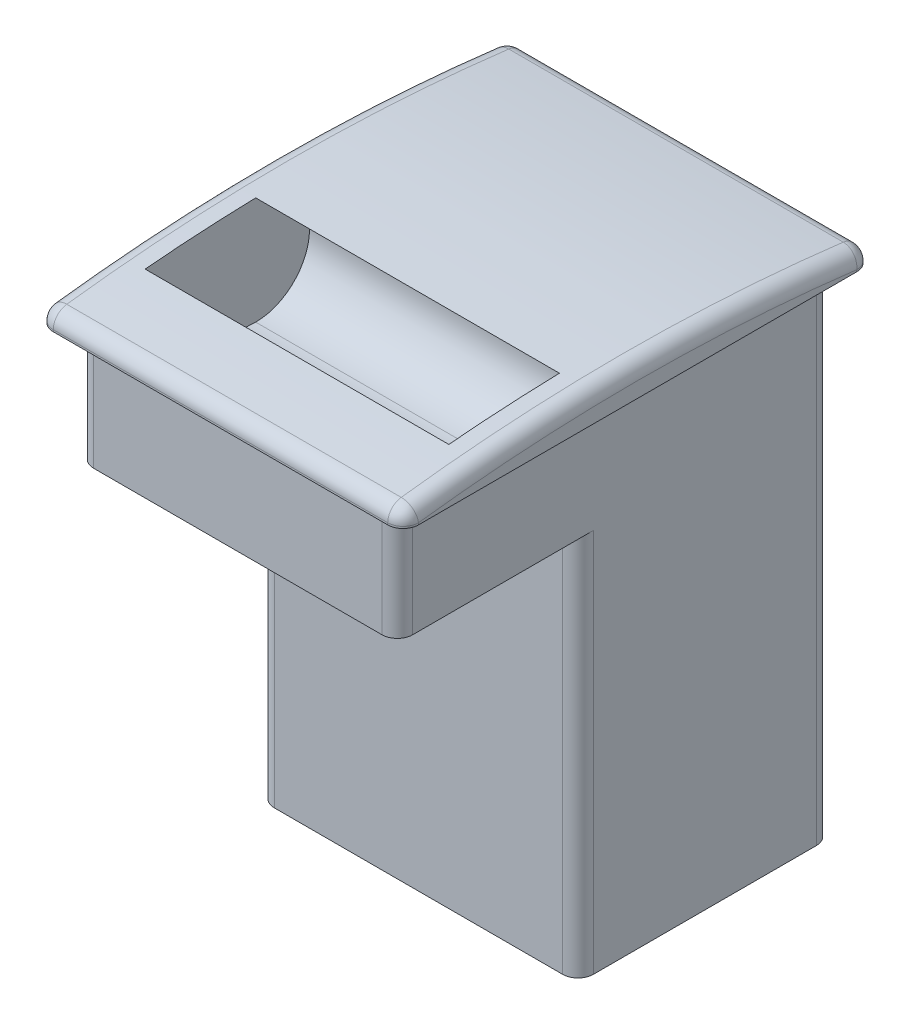
ISO-10303-21;
HEADER;
FILE_DESCRIPTION(('STEP AP214'),'2;1');
FILE_NAME('part.step','',(''),(''),'','','');
FILE_SCHEMA(('AUTOMOTIVE_DESIGN { 1 0 10303 214 1 1 1 1 }'));
ENDSEC;
DATA;
#1=APPLICATION_CONTEXT('core data for automotive mechanical design processes');
#2=APPLICATION_PROTOCOL_DEFINITION('international standard','automotive_design',2000,#1);
#3=PRODUCT_CONTEXT('',#1,'mechanical');
#4=PRODUCT('Part','Part','',(#3));
#5=PRODUCT_RELATED_PRODUCT_CATEGORY('part','',(#4));
#6=PRODUCT_DEFINITION_FORMATION('','',#4);
#7=PRODUCT_DEFINITION_CONTEXT('part definition',#1,'design');
#8=PRODUCT_DEFINITION('design','',#6,#7);
#9=PRODUCT_DEFINITION_SHAPE('','',#8);
#10=(LENGTH_UNIT() NAMED_UNIT(*) SI_UNIT(.MILLI.,.METRE.));
#11=(NAMED_UNIT(*) PLANE_ANGLE_UNIT() SI_UNIT($,.RADIAN.));
#12=(NAMED_UNIT(*) SI_UNIT($,.STERADIAN.) SOLID_ANGLE_UNIT());
#13=UNCERTAINTY_MEASURE_WITH_UNIT(LENGTH_MEASURE(1.E-05),#10,'distance_accuracy_value','');
#14=(GEOMETRIC_REPRESENTATION_CONTEXT(3) GLOBAL_UNCERTAINTY_ASSIGNED_CONTEXT((#13)) GLOBAL_UNIT_ASSIGNED_CONTEXT((#10,
#11,#12)) REPRESENTATION_CONTEXT('',''));
#15=CARTESIAN_POINT('',(0.,0.,0.));
#16=DIRECTION('',(0.,0.,1.));
#17=DIRECTION('',(1.,0.,0.));
#18=AXIS2_PLACEMENT_3D('',#15,#16,#17);
#19=CARTESIAN_POINT('',(0.,-15.,0.));
#20=DIRECTION('',(0.,1.,0.));
#21=DIRECTION('',(0.,0.,1.));
#22=AXIS2_PLACEMENT_3D('',#19,#20,#21);
#23=PLANE('',#22);
#24=DIRECTION('',(0.,0.,-1.));
#25=VECTOR('',#24,1.);
#26=CARTESIAN_POINT('',(20.75,-15.,-28.25));
#27=LINE('',#26,#25);
#28=CARTESIAN_POINT('',(20.75,-15.,26.25));
#29=VERTEX_POINT('',#28);
#30=CARTESIAN_POINT('',(20.75,-15.,2.75));
#31=VERTEX_POINT('',#30);
#32=EDGE_CURVE('E493',#29,#31,#27,.T.);
#33=ORIENTED_EDGE('',*,*,#32,.F.);
#34=CARTESIAN_POINT('',(18.75,-15.,26.25));
#35=DIRECTION('',(0.,1.,0.));
#36=DIRECTION('',(0.,0.,1.));
#37=AXIS2_PLACEMENT_3D('',#34,#35,#36);
#38=CIRCLE('',#37,2.);
#39=CARTESIAN_POINT('',(18.75,-15.,28.25));
#40=VERTEX_POINT('',#39);
#41=EDGE_CURVE('E372',#29,#40,#38,.F.);
#42=ORIENTED_EDGE('',*,*,#41,.T.);
#43=DIRECTION('',(1.,0.,0.));
#44=VECTOR('',#43,1.);
#45=CARTESIAN_POINT('',(-20.75,-15.,28.25));
#46=LINE('',#45,#44);
#47=CARTESIAN_POINT('',(-18.75,-15.,28.25));
#48=VERTEX_POINT('',#47);
#49=EDGE_CURVE('E240',#48,#40,#46,.T.);
#50=ORIENTED_EDGE('',*,*,#49,.F.);
#51=CARTESIAN_POINT('',(-18.75,-15.,26.25));
#52=DIRECTION('',(0.,1.,0.));
#53=DIRECTION('',(0.,0.,1.));
#54=AXIS2_PLACEMENT_3D('',#51,#52,#53);
#55=CIRCLE('',#54,2.);
#56=CARTESIAN_POINT('',(-20.75,-15.,26.25));
#57=VERTEX_POINT('',#56);
#58=EDGE_CURVE('E369',#48,#57,#55,.F.);
#59=ORIENTED_EDGE('',*,*,#58,.T.);
#60=DIRECTION('',(0.,0.,1.));
#61=VECTOR('',#60,1.);
#62=CARTESIAN_POINT('',(-20.75,-15.,-28.25));
#63=LINE('',#62,#61);
#64=CARTESIAN_POINT('',(-20.75,-15.,2.75));
#65=VERTEX_POINT('',#64);
#66=EDGE_CURVE('E57',#65,#57,#63,.T.);
#67=ORIENTED_EDGE('',*,*,#66,.F.);
#68=CARTESIAN_POINT('',(-18.75,-15.,2.75));
#69=DIRECTION('',(0.,1.,0.));
#70=DIRECTION('',(0.,0.,1.));
#71=AXIS2_PLACEMENT_3D('',#68,#69,#70);
#72=CIRCLE('',#71,2.);
#73=CARTESIAN_POINT('',(-18.75,-15.,4.75));
#74=VERTEX_POINT('',#73);
#75=EDGE_CURVE('E50',#65,#74,#72,.T.);
#76=ORIENTED_EDGE('',*,*,#75,.T.);
#77=DIRECTION('',(-1.,0.,0.));
#78=VECTOR('',#77,1.);
#79=CARTESIAN_POINT('',(-20.75,-15.,4.75));
#80=LINE('',#79,#78);
#81=CARTESIAN_POINT('',(18.75,-15.,4.75));
#82=VERTEX_POINT('',#81);
#83=EDGE_CURVE('E426',#82,#74,#80,.T.);
#84=ORIENTED_EDGE('',*,*,#83,.F.);
#85=CARTESIAN_POINT('',(18.75,-15.,2.75));
#86=DIRECTION('',(0.,1.,0.));
#87=DIRECTION('',(0.,0.,1.));
#88=AXIS2_PLACEMENT_3D('',#85,#86,#87);
#89=CIRCLE('',#88,2.);
#90=EDGE_CURVE('E414',#82,#31,#89,.T.);
#91=ORIENTED_EDGE('',*,*,#90,.T.);
#92=EDGE_LOOP('',(#33,#42,#50,#59,#67,#76,#84,#91));
#93=FACE_BOUND('',#92,.T.);
#94=ADVANCED_FACE('F41',(#93),#23,.F.);
#95=CARTESIAN_POINT('',(21.75,-229.5625,0.));
#96=DIRECTION('',(-1.,0.,0.));
#97=DIRECTION('',(0.,0.,1.));
#98=AXIS2_PLACEMENT_3D('',#95,#96,#97);
#99=TOROIDAL_SURFACE('',#98,231.5625,2.);
#100=CARTESIAN_POINT('',(21.75,0.23946127589948,-28.5));
#101=DIRECTION('',(0.,-0.123076923076924,-0.992397133715086));
#102=DIRECTION('',(0.,0.992397133715086,-0.123076923076924));
#103=AXIS2_PLACEMENT_3D('',#100,#101,#102);
#104=CIRCLE('',#103,2.);
#105=CARTESIAN_POINT('',(21.75,2.22425554332965,-28.7461538461539));
#106=VERTEX_POINT('',#105);
#107=CARTESIAN_POINT('',(23.75,0.23946127589948,-28.5));
#108=VERTEX_POINT('',#107);
#109=EDGE_CURVE('E349',#106,#108,#104,.T.);
#110=ORIENTED_EDGE('',*,*,#109,.F.);
#111=CARTESIAN_POINT('',(21.75,-229.5625,0.));
#112=DIRECTION('',(-1.,0.,0.));
#113=DIRECTION('',(0.,0.,1.));
#114=AXIS2_PLACEMENT_3D('',#111,#112,#113);
#115=CIRCLE('',#114,233.5625);
#116=CARTESIAN_POINT('',(21.75,2.22425554332965,28.7461538461538));
#117=VERTEX_POINT('',#116);
#118=EDGE_CURVE('E284',#117,#106,#115,.T.);
#119=ORIENTED_EDGE('',*,*,#118,.F.);
#120=CARTESIAN_POINT('',(21.75,0.239461275899476,28.5));
#121=DIRECTION('',(0.,0.123076923076924,-0.992397133715086));
#122=DIRECTION('',(0.,0.992397133715086,0.123076923076924));
#123=AXIS2_PLACEMENT_3D('',#120,#121,#122);
#124=CIRCLE('',#123,2.);
#125=CARTESIAN_POINT('',(23.75,0.239461275899476,28.5));
#126=VERTEX_POINT('',#125);
#127=EDGE_CURVE('E346',#117,#126,#124,.T.);
#128=ORIENTED_EDGE('',*,*,#127,.T.);
#129=CARTESIAN_POINT('',(23.75,-229.5625,0.));
#130=DIRECTION('',(-1.,0.,0.));
#131=DIRECTION('',(0.,0.,1.));
#132=AXIS2_PLACEMENT_3D('',#129,#130,#131);
#133=CIRCLE('',#132,231.5625);
#134=EDGE_CURVE('E324',#108,#126,#133,.F.);
#135=ORIENTED_EDGE('',*,*,#134,.F.);
#136=EDGE_LOOP('',(#110,#119,#128,#135));
#137=FACE_BOUND('',#136,.T.);
#138=ADVANCED_FACE('F557',(#137),#99,.T.);
#139=CARTESIAN_POINT('',(21.75,0.239461275899494,28.5));
#140=DIRECTION('',(0.,0.992397133715085,0.123076923076923));
#141=DIRECTION('',(0.,-0.123076923076923,0.992397133715086));
#142=AXIS2_PLACEMENT_3D('',#139,#140,#141);
#143=SPHERICAL_SURFACE('',#142,2.);
#144=ORIENTED_EDGE('',*,*,#127,.F.);
#145=CARTESIAN_POINT('',(21.75,0.239461275899472,28.5));
#146=DIRECTION('',(1.,0.,0.));
#147=DIRECTION('',(0.,0.,-1.));
#148=AXIS2_PLACEMENT_3D('',#145,#146,#147);
#149=CIRCLE('',#148,2.);
#150=CARTESIAN_POINT('',(21.75,0.239461275899472,30.5));
#151=VERTEX_POINT('',#150);
#152=EDGE_CURVE('E343',#117,#151,#149,.T.);
#153=ORIENTED_EDGE('',*,*,#152,.T.);
#154=CARTESIAN_POINT('',(21.75,0.239461275899494,28.5));
#155=DIRECTION('',(0.,1.,0.));
#156=DIRECTION('',(0.,0.,1.));
#157=AXIS2_PLACEMENT_3D('',#154,#155,#156);
#158=CIRCLE('',#157,2.);
#159=EDGE_CURVE('E320',#126,#151,#158,.F.);
#160=ORIENTED_EDGE('',*,*,#159,.F.);
#161=EDGE_LOOP('',(#144,#153,#160));
#162=FACE_BOUND('',#161,.T.);
#163=ADVANCED_FACE('F562',(#162),#143,.T.);
#164=CARTESIAN_POINT('',(-87.8810068623117,0.239461275899411,28.5));
#165=DIRECTION('',(1.,0.,0.));
#166=DIRECTION('',(0.,0.,-1.));
#167=AXIS2_PLACEMENT_3D('',#164,#165,#166);
#168=CYLINDRICAL_SURFACE('',#167,2.);
#169=ORIENTED_EDGE('',*,*,#152,.F.);
#170=DIRECTION('',(1.,0.,0.));
#171=VECTOR('',#170,1.);
#172=CARTESIAN_POINT('',(-87.8810068623117,2.22425554332967,28.7461538461539));
#173=LINE('',#172,#171);
#174=CARTESIAN_POINT('',(-21.75,2.22425554332964,28.7461538461539));
#175=VERTEX_POINT('',#174);
#176=EDGE_CURVE('E288',#175,#117,#173,.T.);
#177=ORIENTED_EDGE('',*,*,#176,.F.);
#178=CARTESIAN_POINT('',(-21.75,0.239461275899472,28.5));
#179=DIRECTION('',(1.,0.,0.));
#180=DIRECTION('',(0.,0.,-1.));
#181=AXIS2_PLACEMENT_3D('',#178,#179,#180);
#182=CIRCLE('',#181,2.);
#183=CARTESIAN_POINT('',(-21.75,0.239461275899472,30.5));
#184=VERTEX_POINT('',#183);
#185=EDGE_CURVE('E340',#175,#184,#182,.T.);
#186=ORIENTED_EDGE('',*,*,#185,.T.);
#187=DIRECTION('',(1.,0.,0.));
#188=VECTOR('',#187,1.);
#189=CARTESIAN_POINT('',(-87.8810068623117,0.239461275899411,30.5));
#190=LINE('',#189,#188);
#191=EDGE_CURVE('E316',#151,#184,#190,.F.);
#192=ORIENTED_EDGE('',*,*,#191,.F.);
#193=EDGE_LOOP('',(#169,#177,#186,#192));
#194=FACE_BOUND('',#193,.T.);
#195=ADVANCED_FACE('F612',(#194),#168,.T.);
#196=CARTESIAN_POINT('',(-21.75,0.239461275899439,28.5));
#197=DIRECTION('',(0.,0.992397133715085,0.123076923076923));
#198=DIRECTION('',(0.,-0.123076923076923,0.992397133715086));
#199=AXIS2_PLACEMENT_3D('',#196,#197,#198);
#200=SPHERICAL_SURFACE('',#199,2.);
#201=ORIENTED_EDGE('',*,*,#185,.F.);
#202=CARTESIAN_POINT('',(-21.75,0.239461275899475,28.5));
#203=DIRECTION('',(0.,-0.123076923076924,0.992397133715086));
#204=DIRECTION('',(0.,-0.992397133715086,-0.123076923076924));
#205=AXIS2_PLACEMENT_3D('',#202,#203,#204);
#206=CIRCLE('',#205,2.);
#207=CARTESIAN_POINT('',(-23.75,0.239461275899475,28.5));
#208=VERTEX_POINT('',#207);
#209=EDGE_CURVE('E337',#175,#208,#206,.T.);
#210=ORIENTED_EDGE('',*,*,#209,.T.);
#211=CARTESIAN_POINT('',(-21.75,0.239461275899439,28.5));
#212=DIRECTION('',(0.,-1.,0.));
#213=DIRECTION('',(0.,0.,-1.));
#214=AXIS2_PLACEMENT_3D('',#211,#212,#213);
#215=CIRCLE('',#214,2.);
#216=EDGE_CURVE('E312',#184,#208,#215,.T.);
#217=ORIENTED_EDGE('',*,*,#216,.F.);
#218=EDGE_LOOP('',(#201,#210,#217));
#219=FACE_BOUND('',#218,.T.);
#220=ADVANCED_FACE('F608',(#219),#200,.T.);
#221=CARTESIAN_POINT('',(-21.75,-229.5625,0.));
#222=DIRECTION('',(-1.,0.,0.));
#223=DIRECTION('',(0.,0.,1.));
#224=AXIS2_PLACEMENT_3D('',#221,#222,#223);
#225=TOROIDAL_SURFACE('',#224,231.5625,2.);
#226=ORIENTED_EDGE('',*,*,#209,.F.);
#227=CARTESIAN_POINT('',(-21.75,-229.5625,0.));
#228=DIRECTION('',(-1.,0.,0.));
#229=DIRECTION('',(0.,0.,1.));
#230=AXIS2_PLACEMENT_3D('',#227,#228,#229);
#231=CIRCLE('',#230,233.5625);
#232=CARTESIAN_POINT('',(-21.75,2.22425554332964,-28.7461538461538));
#233=VERTEX_POINT('',#232);
#234=EDGE_CURVE('E292',#233,#175,#231,.F.);
#235=ORIENTED_EDGE('',*,*,#234,.F.);
#236=CARTESIAN_POINT('',(-21.75,0.239461275899468,-28.5));
#237=DIRECTION('',(0.,0.123076923076924,0.992397133715086));
#238=DIRECTION('',(0.,-0.992397133715086,0.123076923076924));
#239=AXIS2_PLACEMENT_3D('',#236,#237,#238);
#240=CIRCLE('',#239,2.);
#241=CARTESIAN_POINT('',(-23.75,0.239461275899468,-28.5));
#242=VERTEX_POINT('',#241);
#243=EDGE_CURVE('E334',#233,#242,#240,.T.);
#244=ORIENTED_EDGE('',*,*,#243,.T.);
#245=CARTESIAN_POINT('',(-23.75,-229.5625,0.));
#246=DIRECTION('',(-1.,0.,0.));
#247=DIRECTION('',(0.,0.,1.));
#248=AXIS2_PLACEMENT_3D('',#245,#246,#247);
#249=CIRCLE('',#248,231.5625);
#250=EDGE_CURVE('E308',#208,#242,#249,.T.);
#251=ORIENTED_EDGE('',*,*,#250,.F.);
#252=EDGE_LOOP('',(#226,#235,#244,#251));
#253=FACE_BOUND('',#252,.T.);
#254=ADVANCED_FACE('F604',(#253),#225,.T.);
#255=CARTESIAN_POINT('',(-21.75,0.239461275899439,-28.5));
#256=DIRECTION('',(0.,0.992397133715085,-0.123076923076923));
#257=DIRECTION('',(0.,0.123076923076923,0.992397133715086));
#258=AXIS2_PLACEMENT_3D('',#255,#256,#257);
#259=SPHERICAL_SURFACE('',#258,2.);
#260=ORIENTED_EDGE('',*,*,#243,.F.);
#261=CARTESIAN_POINT('',(-21.75,0.23946127589948,-28.5));
#262=DIRECTION('',(-1.,0.,0.));
#263=DIRECTION('',(0.,0.,1.));
#264=AXIS2_PLACEMENT_3D('',#261,#262,#263);
#265=CIRCLE('',#264,2.);
#266=CARTESIAN_POINT('',(-21.75,0.23946127589948,-30.5));
#267=VERTEX_POINT('',#266);
#268=EDGE_CURVE('E331',#233,#267,#265,.T.);
#269=ORIENTED_EDGE('',*,*,#268,.T.);
#270=CARTESIAN_POINT('',(-21.75,0.239461275899439,-28.5));
#271=DIRECTION('',(0.,1.,0.));
#272=DIRECTION('',(0.,0.,1.));
#273=AXIS2_PLACEMENT_3D('',#270,#271,#272);
#274=CIRCLE('',#273,2.);
#275=EDGE_CURVE('E304',#242,#267,#274,.F.);
#276=ORIENTED_EDGE('',*,*,#275,.F.);
#277=EDGE_LOOP('',(#260,#269,#276));
#278=FACE_BOUND('',#277,.T.);
#279=ADVANCED_FACE('F600',(#278),#259,.T.);
#280=CARTESIAN_POINT('',(-87.8810068623117,0.239461275899411,-28.5));
#281=DIRECTION('',(1.,0.,0.));
#282=DIRECTION('',(0.,0.,-1.));
#283=AXIS2_PLACEMENT_3D('',#280,#281,#282);
#284=CYLINDRICAL_SURFACE('',#283,2.);
#285=ORIENTED_EDGE('',*,*,#268,.F.);
#286=DIRECTION('',(1.,0.,0.));
#287=VECTOR('',#286,1.);
#288=CARTESIAN_POINT('',(-87.8810068623117,2.22425554332967,-28.7461538461538));
#289=LINE('',#288,#287);
#290=EDGE_CURVE('E296',#106,#233,#289,.F.);
#291=ORIENTED_EDGE('',*,*,#290,.F.);
#292=CARTESIAN_POINT('',(21.75,0.23946127589948,-28.5));
#293=DIRECTION('',(-1.,0.,0.));
#294=DIRECTION('',(0.,0.,1.));
#295=AXIS2_PLACEMENT_3D('',#292,#293,#294);
#296=CIRCLE('',#295,2.);
#297=CARTESIAN_POINT('',(21.75,0.23946127589948,-30.5));
#298=VERTEX_POINT('',#297);
#299=EDGE_CURVE('E328',#106,#298,#296,.T.);
#300=ORIENTED_EDGE('',*,*,#299,.T.);
#301=DIRECTION('',(1.,0.,0.));
#302=VECTOR('',#301,1.);
#303=CARTESIAN_POINT('',(-87.8810068623117,0.239461275899411,-30.5));
#304=LINE('',#303,#302);
#305=EDGE_CURVE('E300',#267,#298,#304,.T.);
#306=ORIENTED_EDGE('',*,*,#305,.F.);
#307=EDGE_LOOP('',(#285,#291,#300,#306));
#308=FACE_BOUND('',#307,.T.);
#309=ADVANCED_FACE('F596',(#308),#284,.T.);
#310=CARTESIAN_POINT('',(21.75,0.239461275899494,-28.5));
#311=DIRECTION('',(0.,0.992397133715085,-0.123076923076923));
#312=DIRECTION('',(0.,0.123076923076923,0.992397133715086));
#313=AXIS2_PLACEMENT_3D('',#310,#311,#312);
#314=SPHERICAL_SURFACE('',#313,2.);
#315=ORIENTED_EDGE('',*,*,#299,.F.);
#316=ORIENTED_EDGE('',*,*,#109,.T.);
#317=CARTESIAN_POINT('',(21.75,0.239461275899494,-28.5));
#318=DIRECTION('',(0.,-1.,0.));
#319=DIRECTION('',(0.,0.,-1.));
#320=AXIS2_PLACEMENT_3D('',#317,#318,#319);
#321=CIRCLE('',#320,2.);
#322=EDGE_CURVE('E280',#298,#108,#321,.T.);
#323=ORIENTED_EDGE('',*,*,#322,.F.);
#324=EDGE_LOOP('',(#315,#316,#323));
#325=FACE_BOUND('',#324,.T.);
#326=ADVANCED_FACE('F576',(#325),#314,.T.);
#327=CARTESIAN_POINT('',(20.75,-15.,-28.25));
#328=DIRECTION('',(1.,0.,0.));
#329=DIRECTION('',(0.,0.,-1.));
#330=AXIS2_PLACEMENT_3D('',#327,#328,#329);
#331=PLANE('',#330);
#332=DIRECTION('',(0.,0.,-1.));
#333=VECTOR('',#332,1.);
#334=CARTESIAN_POINT('',(20.75,0.,-28.25));
#335=LINE('',#334,#333);
#336=CARTESIAN_POINT('',(20.75,0.,26.25));
#337=VERTEX_POINT('',#336);
#338=CARTESIAN_POINT('',(20.75,0.,-26.25));
#339=VERTEX_POINT('',#338);
#340=EDGE_CURVE('E489',#337,#339,#335,.T.);
#341=ORIENTED_EDGE('',*,*,#340,.F.);
#342=DIRECTION('',(0.,1.,0.));
#343=VECTOR('',#342,1.);
#344=CARTESIAN_POINT('',(20.75,-15.,26.25));
#345=LINE('',#344,#343);
#346=EDGE_CURVE('E366',#337,#29,#345,.F.);
#347=ORIENTED_EDGE('',*,*,#346,.T.);
#348=ORIENTED_EDGE('',*,*,#32,.T.);
#349=DIRECTION('',(0.,1.,0.));
#350=VECTOR('',#349,1.);
#351=CARTESIAN_POINT('',(20.75,-65.,2.75));
#352=LINE('',#351,#350);
#353=CARTESIAN_POINT('',(20.75,-65.,2.75));
#354=VERTEX_POINT('',#353);
#355=EDGE_CURVE('E363',#31,#354,#352,.F.);
#356=ORIENTED_EDGE('',*,*,#355,.T.);
#357=DIRECTION('',(0.,0.,1.));
#358=VECTOR('',#357,1.);
#359=CARTESIAN_POINT('',(20.75,-65.,-28.25));
#360=LINE('',#359,#358);
#361=CARTESIAN_POINT('',(20.75,-65.,-26.25));
#362=VERTEX_POINT('',#361);
#363=EDGE_CURVE('E456',#362,#354,#360,.T.);
#364=ORIENTED_EDGE('',*,*,#363,.F.);
#365=DIRECTION('',(0.,1.,0.));
#366=VECTOR('',#365,1.);
#367=CARTESIAN_POINT('',(20.75,-15.,-26.25));
#368=LINE('',#367,#366);
#369=EDGE_CURVE('E359',#362,#339,#368,.T.);
#370=ORIENTED_EDGE('',*,*,#369,.T.);
#371=EDGE_LOOP('',(#341,#347,#348,#356,#364,#370));
#372=FACE_BOUND('',#371,.T.);
#373=ADVANCED_FACE('F538',(#372),#331,.T.);
#374=CARTESIAN_POINT('',(-20.75,-15.,28.25));
#375=DIRECTION('',(0.,0.,1.));
#376=DIRECTION('',(1.,0.,0.));
#377=AXIS2_PLACEMENT_3D('',#374,#375,#376);
#378=PLANE('',#377);
#379=ORIENTED_EDGE('',*,*,#49,.T.);
#380=DIRECTION('',(0.,1.,0.));
#381=VECTOR('',#380,1.);
#382=CARTESIAN_POINT('',(18.75,-15.,28.25));
#383=LINE('',#382,#381);
#384=CARTESIAN_POINT('',(18.75,0.,28.25));
#385=VERTEX_POINT('',#384);
#386=EDGE_CURVE('E355',#40,#385,#383,.T.);
#387=ORIENTED_EDGE('',*,*,#386,.T.);
#388=DIRECTION('',(1.,0.,0.));
#389=VECTOR('',#388,1.);
#390=CARTESIAN_POINT('',(-20.75,0.,28.25));
#391=LINE('',#390,#389);
#392=CARTESIAN_POINT('',(-18.75,0.,28.25));
#393=VERTEX_POINT('',#392);
#394=EDGE_CURVE('E496',#393,#385,#391,.T.);
#395=ORIENTED_EDGE('',*,*,#394,.F.);
#396=DIRECTION('',(0.,1.,0.));
#397=VECTOR('',#396,1.);
#398=CARTESIAN_POINT('',(-18.75,-15.,28.25));
#399=LINE('',#398,#397);
#400=EDGE_CURVE('E352',#393,#48,#399,.F.);
#401=ORIENTED_EDGE('',*,*,#400,.T.);
#402=EDGE_LOOP('',(#379,#387,#395,#401));
#403=FACE_BOUND('',#402,.T.);
#404=ADVANCED_FACE('F520',(#403),#378,.T.);
#405=CARTESIAN_POINT('',(-20.75,-15.,-28.25));
#406=DIRECTION('',(-1.,0.,0.));
#407=DIRECTION('',(0.,0.,1.));
#408=AXIS2_PLACEMENT_3D('',#405,#406,#407);
#409=PLANE('',#408);
#410=ORIENTED_EDGE('',*,*,#66,.T.);
#411=DIRECTION('',(0.,1.,0.));
#412=VECTOR('',#411,1.);
#413=CARTESIAN_POINT('',(-20.75,-15.,26.25));
#414=LINE('',#413,#412);
#415=CARTESIAN_POINT('',(-20.75,0.,26.25));
#416=VERTEX_POINT('',#415);
#417=EDGE_CURVE('E408',#57,#416,#414,.T.);
#418=ORIENTED_EDGE('',*,*,#417,.T.);
#419=DIRECTION('',(0.,0.,1.));
#420=VECTOR('',#419,1.);
#421=CARTESIAN_POINT('',(-20.75,0.,-28.25));
#422=LINE('',#421,#420);
#423=CARTESIAN_POINT('',(-20.75,0.,-26.25));
#424=VERTEX_POINT('',#423);
#425=EDGE_CURVE('E509',#424,#416,#422,.T.);
#426=ORIENTED_EDGE('',*,*,#425,.F.);
#427=DIRECTION('',(0.,1.,0.));
#428=VECTOR('',#427,1.);
#429=CARTESIAN_POINT('',(-20.75,-15.,-26.25));
#430=LINE('',#429,#428);
#431=CARTESIAN_POINT('',(-20.75,-65.,-26.25));
#432=VERTEX_POINT('',#431);
#433=EDGE_CURVE('E401',#424,#432,#430,.F.);
#434=ORIENTED_EDGE('',*,*,#433,.T.);
#435=DIRECTION('',(0.,0.,-1.));
#436=VECTOR('',#435,1.);
#437=CARTESIAN_POINT('',(-20.75,-65.,-28.25));
#438=LINE('',#437,#436);
#439=CARTESIAN_POINT('',(-20.75,-65.,2.75));
#440=VERTEX_POINT('',#439);
#441=EDGE_CURVE('E436',#440,#432,#438,.T.);
#442=ORIENTED_EDGE('',*,*,#441,.F.);
#443=DIRECTION('',(0.,1.,0.));
#444=VECTOR('',#443,1.);
#445=CARTESIAN_POINT('',(-20.75,-15.,2.75));
#446=LINE('',#445,#444);
#447=EDGE_CURVE('E404',#440,#65,#446,.T.);
#448=ORIENTED_EDGE('',*,*,#447,.T.);
#449=EDGE_LOOP('',(#410,#418,#426,#434,#442,#448));
#450=FACE_BOUND('',#449,.T.);
#451=ADVANCED_FACE('F448',(#450),#409,.T.);
#452=CARTESIAN_POINT('',(-20.75,-15.,-28.25));
#453=DIRECTION('',(0.,0.,-1.));
#454=DIRECTION('',(-1.,0.,0.));
#455=AXIS2_PLACEMENT_3D('',#452,#453,#454);
#456=PLANE('',#455);
#457=DIRECTION('',(-1.,0.,0.));
#458=VECTOR('',#457,1.);
#459=CARTESIAN_POINT('',(-20.75,0.,-28.25));
#460=LINE('',#459,#458);
#461=CARTESIAN_POINT('',(18.75,0.,-28.25));
#462=VERTEX_POINT('',#461);
#463=CARTESIAN_POINT('',(-18.75,0.,-28.25));
#464=VERTEX_POINT('',#463);
#465=EDGE_CURVE('E505',#462,#464,#460,.T.);
#466=ORIENTED_EDGE('',*,*,#465,.F.);
#467=DIRECTION('',(0.,1.,0.));
#468=VECTOR('',#467,1.);
#469=CARTESIAN_POINT('',(18.75,-15.,-28.25));
#470=LINE('',#469,#468);
#471=CARTESIAN_POINT('',(18.75,-65.,-28.25));
#472=VERTEX_POINT('',#471);
#473=EDGE_CURVE('E398',#462,#472,#470,.F.);
#474=ORIENTED_EDGE('',*,*,#473,.T.);
#475=DIRECTION('',(1.,0.,0.));
#476=VECTOR('',#475,1.);
#477=CARTESIAN_POINT('',(-20.75,-65.,-28.25));
#478=LINE('',#477,#476);
#479=CARTESIAN_POINT('',(-18.75,-65.,-28.25));
#480=VERTEX_POINT('',#479);
#481=EDGE_CURVE('E452',#480,#472,#478,.T.);
#482=ORIENTED_EDGE('',*,*,#481,.F.);
#483=DIRECTION('',(0.,1.,0.));
#484=VECTOR('',#483,1.);
#485=CARTESIAN_POINT('',(-18.75,-15.,-28.25));
#486=LINE('',#485,#484);
#487=EDGE_CURVE('E394',#480,#464,#486,.T.);
#488=ORIENTED_EDGE('',*,*,#487,.T.);
#489=EDGE_LOOP('',(#466,#474,#482,#488));
#490=FACE_BOUND('',#489,.T.);
#491=ADVANCED_FACE('F530',(#490),#456,.T.);
#492=CARTESIAN_POINT('',(-23.75,-15.,-28.25));
#493=DIRECTION('',(-1.,0.,0.));
#494=DIRECTION('',(0.,0.,1.));
#495=AXIS2_PLACEMENT_3D('',#492,#493,#494);
#496=PLANE('',#495);
#497=DIRECTION('',(0.,-1.,0.));
#498=VECTOR('',#497,1.);
#499=CARTESIAN_POINT('',(-23.75,-15.,28.5));
#500=LINE('',#499,#498);
#501=CARTESIAN_POINT('',(-23.75,0.,28.5));
#502=VERTEX_POINT('',#501);
#503=EDGE_CURVE('E266',#502,#208,#500,.F.);
#504=ORIENTED_EDGE('',*,*,#503,.T.);
#505=ORIENTED_EDGE('',*,*,#250,.T.);
#506=DIRECTION('',(0.,1.,0.));
#507=VECTOR('',#506,1.);
#508=CARTESIAN_POINT('',(-23.75,-15.,-28.5));
#509=LINE('',#508,#507);
#510=CARTESIAN_POINT('',(-23.75,0.,-28.5));
#511=VERTEX_POINT('',#510);
#512=EDGE_CURVE('E270',#242,#511,#509,.F.);
#513=ORIENTED_EDGE('',*,*,#512,.T.);
#514=DIRECTION('',(0.,0.,-1.));
#515=VECTOR('',#514,1.);
#516=CARTESIAN_POINT('',(-23.75,0.,30.5));
#517=LINE('',#516,#515);
#518=EDGE_CURVE('E481',#502,#511,#517,.T.);
#519=ORIENTED_EDGE('',*,*,#518,.F.);
#520=EDGE_LOOP('',(#504,#505,#513,#519));
#521=FACE_BOUND('',#520,.T.);
#522=ADVANCED_FACE('F566',(#521),#496,.T.);
#523=CARTESIAN_POINT('',(-87.8810068623117,2.,30.5));
#524=DIRECTION('',(0.,0.,1.));
#525=DIRECTION('',(1.,0.,0.));
#526=AXIS2_PLACEMENT_3D('',#523,#524,#525);
#527=PLANE('',#526);
#528=DIRECTION('',(0.,-1.,0.));
#529=VECTOR('',#528,1.);
#530=CARTESIAN_POINT('',(21.75,2.,30.5));
#531=LINE('',#530,#529);
#532=CARTESIAN_POINT('',(21.75,0.,30.5));
#533=VERTEX_POINT('',#532);
#534=EDGE_CURVE('E273',#533,#151,#531,.F.);
#535=ORIENTED_EDGE('',*,*,#534,.T.);
#536=ORIENTED_EDGE('',*,*,#191,.T.);
#537=DIRECTION('',(0.,-1.,0.));
#538=VECTOR('',#537,1.);
#539=CARTESIAN_POINT('',(-21.75,2.,30.5));
#540=LINE('',#539,#538);
#541=CARTESIAN_POINT('',(-21.75,0.,30.5));
#542=VERTEX_POINT('',#541);
#543=EDGE_CURVE('E277',#184,#542,#540,.T.);
#544=ORIENTED_EDGE('',*,*,#543,.T.);
#545=DIRECTION('',(1.,0.,0.));
#546=VECTOR('',#545,1.);
#547=CARTESIAN_POINT('',(-87.8810068623117,0.,30.5));
#548=LINE('',#547,#546);
#549=EDGE_CURVE('E480',#542,#533,#548,.T.);
#550=ORIENTED_EDGE('',*,*,#549,.T.);
#551=EDGE_LOOP('',(#535,#536,#544,#550));
#552=FACE_BOUND('',#551,.T.);
#553=ADVANCED_FACE('F644',(#552),#527,.T.);
#554=CARTESIAN_POINT('',(-87.8810068623117,0.,30.5));
#555=DIRECTION('',(0.,-1.,0.));
#556=DIRECTION('',(0.,0.,-1.));
#557=AXIS2_PLACEMENT_3D('',#554,#555,#556);
#558=PLANE('',#557);
#559=ORIENTED_EDGE('',*,*,#425,.T.);
#560=CARTESIAN_POINT('',(-18.75,0.,26.25));
#561=DIRECTION('',(0.,-1.,0.));
#562=DIRECTION('',(0.,0.,-1.));
#563=AXIS2_PLACEMENT_3D('',#560,#561,#562);
#564=CIRCLE('',#563,2.);
#565=EDGE_CURVE('E65',#416,#393,#564,.F.);
#566=ORIENTED_EDGE('',*,*,#565,.T.);
#567=ORIENTED_EDGE('',*,*,#394,.T.);
#568=CARTESIAN_POINT('',(18.75,0.,26.25));
#569=DIRECTION('',(0.,-1.,0.));
#570=DIRECTION('',(0.,0.,-1.));
#571=AXIS2_PLACEMENT_3D('',#568,#569,#570);
#572=CIRCLE('',#571,2.);
#573=EDGE_CURVE('E411',#385,#337,#572,.F.);
#574=ORIENTED_EDGE('',*,*,#573,.T.);
#575=ORIENTED_EDGE('',*,*,#340,.T.);
#576=CARTESIAN_POINT('',(18.75,0.,-26.25));
#577=DIRECTION('',(0.,-1.,0.));
#578=DIRECTION('',(0.,0.,-1.));
#579=AXIS2_PLACEMENT_3D('',#576,#577,#578);
#580=CIRCLE('',#579,2.);
#581=EDGE_CURVE('E418',#339,#462,#580,.F.);
#582=ORIENTED_EDGE('',*,*,#581,.T.);
#583=ORIENTED_EDGE('',*,*,#465,.T.);
#584=CARTESIAN_POINT('',(-18.75,0.,-26.25));
#585=DIRECTION('',(0.,-1.,0.));
#586=DIRECTION('',(0.,0.,-1.));
#587=AXIS2_PLACEMENT_3D('',#584,#585,#586);
#588=CIRCLE('',#587,2.);
#589=EDGE_CURVE('E12',#464,#424,#588,.F.);
#590=ORIENTED_EDGE('',*,*,#589,.T.);
#591=EDGE_LOOP('',(#559,#566,#567,#574,#575,#582,#583,#590));
#592=FACE_BOUND('',#591,.T.);
#593=DIRECTION('',(1.,0.,0.));
#594=VECTOR('',#593,1.);
#595=CARTESIAN_POINT('',(-87.8810068623117,0.,-30.5));
#596=LINE('',#595,#594);
#597=CARTESIAN_POINT('',(-21.75,0.,-30.5));
#598=VERTEX_POINT('',#597);
#599=CARTESIAN_POINT('',(21.75,0.,-30.5));
#600=VERTEX_POINT('',#599);
#601=EDGE_CURVE('E485',#598,#600,#596,.T.);
#602=ORIENTED_EDGE('',*,*,#601,.T.);
#603=CARTESIAN_POINT('',(21.75,0.,-28.5));
#604=DIRECTION('',(0.,-1.,0.));
#605=DIRECTION('',(0.,0.,-1.));
#606=AXIS2_PLACEMENT_3D('',#603,#604,#605);
#607=CIRCLE('',#606,2.);
#608=CARTESIAN_POINT('',(23.75,0.,-28.5));
#609=VERTEX_POINT('',#608);
#610=EDGE_CURVE('E263',#600,#609,#607,.T.);
#611=ORIENTED_EDGE('',*,*,#610,.T.);
#612=DIRECTION('',(0.,0.,-1.));
#613=VECTOR('',#612,1.);
#614=CARTESIAN_POINT('',(23.75,0.,30.5));
#615=LINE('',#614,#613);
#616=CARTESIAN_POINT('',(23.75,0.,28.5));
#617=VERTEX_POINT('',#616);
#618=EDGE_CURVE('E476',#617,#609,#615,.T.);
#619=ORIENTED_EDGE('',*,*,#618,.F.);
#620=CARTESIAN_POINT('',(21.75,0.,28.5));
#621=DIRECTION('',(0.,-1.,0.));
#622=DIRECTION('',(0.,0.,-1.));
#623=AXIS2_PLACEMENT_3D('',#620,#621,#622);
#624=CIRCLE('',#623,2.);
#625=EDGE_CURVE('E254',#617,#533,#624,.T.);
#626=ORIENTED_EDGE('',*,*,#625,.T.);
#627=ORIENTED_EDGE('',*,*,#549,.F.);
#628=CARTESIAN_POINT('',(-21.75,0.,28.5));
#629=DIRECTION('',(0.,-1.,0.));
#630=DIRECTION('',(0.,0.,-1.));
#631=AXIS2_PLACEMENT_3D('',#628,#629,#630);
#632=CIRCLE('',#631,2.);
#633=EDGE_CURVE('E257',#542,#502,#632,.T.);
#634=ORIENTED_EDGE('',*,*,#633,.T.);
#635=ORIENTED_EDGE('',*,*,#518,.T.);
#636=CARTESIAN_POINT('',(-21.75,0.,-28.5));
#637=DIRECTION('',(0.,-1.,0.));
#638=DIRECTION('',(0.,0.,-1.));
#639=AXIS2_PLACEMENT_3D('',#636,#637,#638);
#640=CIRCLE('',#639,2.);
#641=EDGE_CURVE('E260',#511,#598,#640,.T.);
#642=ORIENTED_EDGE('',*,*,#641,.T.);
#643=EDGE_LOOP('',(#602,#611,#619,#626,#627,#634,#635,#642));
#644=FACE_BOUND('',#643,.T.);
#645=ADVANCED_FACE('F516',(#592,#644),#558,.T.);
#646=CARTESIAN_POINT('',(-87.8810068623117,0.,-30.5));
#647=DIRECTION('',(0.,0.,-1.));
#648=DIRECTION('',(-1.,0.,0.));
#649=AXIS2_PLACEMENT_3D('',#646,#647,#648);
#650=PLANE('',#649);
#651=DIRECTION('',(0.,1.,0.));
#652=VECTOR('',#651,1.);
#653=CARTESIAN_POINT('',(-21.75,0.,-30.5));
#654=LINE('',#653,#652);
#655=EDGE_CURVE('E247',#598,#267,#654,.T.);
#656=ORIENTED_EDGE('',*,*,#655,.T.);
#657=ORIENTED_EDGE('',*,*,#305,.T.);
#658=DIRECTION('',(0.,1.,0.));
#659=VECTOR('',#658,1.);
#660=CARTESIAN_POINT('',(21.75,0.,-30.5));
#661=LINE('',#660,#659);
#662=EDGE_CURVE('E251',#298,#600,#661,.F.);
#663=ORIENTED_EDGE('',*,*,#662,.T.);
#664=ORIENTED_EDGE('',*,*,#601,.F.);
#665=EDGE_LOOP('',(#656,#657,#663,#664));
#666=FACE_BOUND('',#665,.T.);
#667=ADVANCED_FACE('F654',(#666),#650,.T.);
#668=CARTESIAN_POINT('',(-87.8810068623117,-229.5625,0.));
#669=DIRECTION('',(1.,0.,0.));
#670=DIRECTION('',(0.,0.,-1.));
#671=AXIS2_PLACEMENT_3D('',#668,#669,#670);
#672=CYLINDRICAL_SURFACE('',#671,233.5625);
#673=ORIENTED_EDGE('',*,*,#118,.T.);
#674=ORIENTED_EDGE('',*,*,#290,.T.);
#675=ORIENTED_EDGE('',*,*,#234,.T.);
#676=ORIENTED_EDGE('',*,*,#176,.T.);
#677=EDGE_LOOP('',(#673,#674,#675,#676));
#678=FACE_BOUND('',#677,.T.);
#679=DIRECTION('',(1.,0.,0.));
#680=VECTOR('',#679,1.);
#681=CARTESIAN_POINT('',(-49.6352469188096,3.91850229004202,6.16951990736579));
#682=LINE('',#681,#680);
#683=CARTESIAN_POINT('',(-19.75,3.91850229004202,6.16951990736578));
#684=VERTEX_POINT('',#683);
#685=CARTESIAN_POINT('',(19.75,3.91850229004202,6.16951990736578));
#686=VERTEX_POINT('',#685);
#687=EDGE_CURVE('E209',#684,#686,#682,.T.);
#688=ORIENTED_EDGE('',*,*,#687,.T.);
#689=CARTESIAN_POINT('',(19.75,-229.5625,0.));
#690=DIRECTION('',(1.,0.,0.));
#691=DIRECTION('',(0.,0.,-1.));
#692=AXIS2_PLACEMENT_3D('',#689,#690,#691);
#693=CIRCLE('',#692,233.5625);
#694=CARTESIAN_POINT('',(19.75,3.09331872518814,20.5599469737253));
#695=VERTEX_POINT('',#694);
#696=EDGE_CURVE('E234',#695,#686,#693,.F.);
#697=ORIENTED_EDGE('',*,*,#696,.F.);
#698=DIRECTION('',(1.,0.,0.));
#699=VECTOR('',#698,1.);
#700=CARTESIAN_POINT('',(-49.6352469188096,3.09331872518814,20.5599469737253));
#701=LINE('',#700,#699);
#702=CARTESIAN_POINT('',(-19.75,3.09331872518813,20.5599469737253));
#703=VERTEX_POINT('',#702);
#704=EDGE_CURVE('E220',#703,#695,#701,.T.);
#705=ORIENTED_EDGE('',*,*,#704,.F.);
#706=CARTESIAN_POINT('',(-19.75,-229.5625,0.));
#707=DIRECTION('',(-1.,0.,0.));
#708=DIRECTION('',(0.,0.,1.));
#709=AXIS2_PLACEMENT_3D('',#706,#707,#708);
#710=CIRCLE('',#709,233.5625);
#711=EDGE_CURVE('E225',#684,#703,#710,.F.);
#712=ORIENTED_EDGE('',*,*,#711,.F.);
#713=EDGE_LOOP('',(#688,#697,#705,#712));
#714=FACE_BOUND('',#713,.T.);
#715=ADVANCED_FACE('F231',(#678,#714),#672,.T.);
#716=CARTESIAN_POINT('',(23.75,-229.5625,0.));
#717=DIRECTION('',(-1.,0.,0.));
#718=DIRECTION('',(0.,0.,1.));
#719=AXIS2_PLACEMENT_3D('',#716,#717,#718);
#720=PLANE('',#719);
#721=DIRECTION('',(0.,1.,0.));
#722=VECTOR('',#721,1.);
#723=CARTESIAN_POINT('',(23.75,2.,-28.5));
#724=LINE('',#723,#722);
#725=EDGE_CURVE('E238',#609,#108,#724,.T.);
#726=ORIENTED_EDGE('',*,*,#725,.T.);
#727=ORIENTED_EDGE('',*,*,#134,.T.);
#728=DIRECTION('',(0.,-1.,0.));
#729=VECTOR('',#728,1.);
#730=CARTESIAN_POINT('',(23.75,0.,28.5));
#731=LINE('',#730,#729);
#732=EDGE_CURVE('E233',#126,#617,#731,.T.);
#733=ORIENTED_EDGE('',*,*,#732,.T.);
#734=ORIENTED_EDGE('',*,*,#618,.T.);
#735=EDGE_LOOP('',(#726,#727,#733,#734));
#736=FACE_BOUND('',#735,.T.);
#737=ADVANCED_FACE('F649',(#736),#720,.F.);
#738=CARTESIAN_POINT('',(-19.75,-15.,-28.25));
#739=DIRECTION('',(-1.,0.,0.));
#740=DIRECTION('',(0.,0.,1.));
#741=AXIS2_PLACEMENT_3D('',#738,#739,#740);
#742=PLANE('',#741);
#743=ORIENTED_EDGE('',*,*,#711,.T.);
#744=CARTESIAN_POINT('',(-19.75,4.36501018356117,6.16951990736578));
#745=DIRECTION('',(-1.,0.,0.));
#746=DIRECTION('',(0.,0.,1.));
#747=AXIS2_PLACEMENT_3D('',#744,#745,#746);
#748=CIRCLE('',#747,14.4465078935192);
#749=CARTESIAN_POINT('',(-19.75,-10.081497709958,6.16951990736578));
#750=VERTEX_POINT('',#749);
#751=EDGE_CURVE('E227',#703,#750,#748,.F.);
#752=ORIENTED_EDGE('',*,*,#751,.T.);
#753=CARTESIAN_POINT('',(-19.75,-3.08149770995798,6.16951990736578));
#754=DIRECTION('',(-1.,0.,0.));
#755=DIRECTION('',(0.,0.,1.));
#756=AXIS2_PLACEMENT_3D('',#753,#754,#755);
#757=CIRCLE('',#756,7.);
#758=EDGE_CURVE('E212',#750,#684,#757,.F.);
#759=ORIENTED_EDGE('',*,*,#758,.T.);
#760=EDGE_LOOP('',(#743,#752,#759));
#761=FACE_BOUND('',#760,.T.);
#762=ADVANCED_FACE('F224',(#761),#742,.F.);
#763=CARTESIAN_POINT('',(19.75,4.36501018356117,6.16951990736578));
#764=DIRECTION('',(1.,0.,0.));
#765=DIRECTION('',(0.,0.,-1.));
#766=AXIS2_PLACEMENT_3D('',#763,#764,#765);
#767=PLANE('',#766);
#768=ORIENTED_EDGE('',*,*,#696,.T.);
#769=CARTESIAN_POINT('',(19.75,-3.08149770995798,6.16951990736578));
#770=DIRECTION('',(1.,0.,0.));
#771=DIRECTION('',(0.,0.,-1.));
#772=AXIS2_PLACEMENT_3D('',#769,#770,#771);
#773=CIRCLE('',#772,7.);
#774=CARTESIAN_POINT('',(19.75,-10.081497709958,6.16951990736578));
#775=VERTEX_POINT('',#774);
#776=EDGE_CURVE('E215',#775,#686,#773,.T.);
#777=ORIENTED_EDGE('',*,*,#776,.F.);
#778=CARTESIAN_POINT('',(19.75,4.36501018356117,6.16951990736578));
#779=DIRECTION('',(1.,0.,0.));
#780=DIRECTION('',(0.,0.,-1.));
#781=AXIS2_PLACEMENT_3D('',#778,#779,#780);
#782=CIRCLE('',#781,14.4465078935192);
#783=EDGE_CURVE('E462',#695,#775,#782,.T.);
#784=ORIENTED_EDGE('',*,*,#783,.F.);
#785=EDGE_LOOP('',(#768,#777,#784));
#786=FACE_BOUND('',#785,.T.);
#787=ADVANCED_FACE('F678',(#786),#767,.F.);
#788=CARTESIAN_POINT('',(-49.6352469188096,-3.08149770995798,6.16951990736579));
#789=DIRECTION('',(1.,0.,0.));
#790=DIRECTION('',(0.,0.,-1.));
#791=AXIS2_PLACEMENT_3D('',#788,#789,#790);
#792=CYLINDRICAL_SURFACE('',#791,7.);
#793=DIRECTION('',(1.,0.,0.));
#794=VECTOR('',#793,1.);
#795=CARTESIAN_POINT('',(-49.6352469188096,-10.081497709958,6.16951990736579));
#796=LINE('',#795,#794);
#797=EDGE_CURVE('E471',#750,#775,#796,.T.);
#798=ORIENTED_EDGE('',*,*,#797,.T.);
#799=ORIENTED_EDGE('',*,*,#776,.T.);
#800=ORIENTED_EDGE('',*,*,#687,.F.);
#801=ORIENTED_EDGE('',*,*,#758,.F.);
#802=EDGE_LOOP('',(#798,#799,#800,#801));
#803=FACE_BOUND('',#802,.T.);
#804=ADVANCED_FACE('F211',(#803),#792,.F.);
#805=CARTESIAN_POINT('',(-49.6352469188096,4.36501018356117,6.16951990736579));
#806=DIRECTION('',(1.,0.,0.));
#807=DIRECTION('',(0.,0.,-1.));
#808=AXIS2_PLACEMENT_3D('',#805,#806,#807);
#809=CYLINDRICAL_SURFACE('',#808,14.4465078935192);
#810=ORIENTED_EDGE('',*,*,#704,.T.);
#811=ORIENTED_EDGE('',*,*,#783,.T.);
#812=ORIENTED_EDGE('',*,*,#797,.F.);
#813=ORIENTED_EDGE('',*,*,#751,.F.);
#814=EDGE_LOOP('',(#810,#811,#812,#813));
#815=FACE_BOUND('',#814,.T.);
#816=ADVANCED_FACE('F581',(#815),#809,.F.);
#817=CARTESIAN_POINT('',(21.75,-229.5625,-28.5));
#818=DIRECTION('',(0.,-1.,0.));
#819=DIRECTION('',(0.,0.,-1.));
#820=AXIS2_PLACEMENT_3D('',#817,#818,#819);
#821=CYLINDRICAL_SURFACE('',#820,2.);
#822=ORIENTED_EDGE('',*,*,#662,.F.);
#823=ORIENTED_EDGE('',*,*,#322,.T.);
#824=ORIENTED_EDGE('',*,*,#725,.F.);
#825=ORIENTED_EDGE('',*,*,#610,.F.);
#826=EDGE_LOOP('',(#822,#823,#824,#825));
#827=FACE_BOUND('',#826,.T.);
#828=ADVANCED_FACE('F577',(#827),#821,.T.);
#829=CARTESIAN_POINT('',(-21.75,0.,-28.5));
#830=DIRECTION('',(0.,1.,0.));
#831=DIRECTION('',(0.,0.,1.));
#832=AXIS2_PLACEMENT_3D('',#829,#830,#831);
#833=CYLINDRICAL_SURFACE('',#832,2.);
#834=ORIENTED_EDGE('',*,*,#512,.F.);
#835=ORIENTED_EDGE('',*,*,#275,.T.);
#836=ORIENTED_EDGE('',*,*,#655,.F.);
#837=ORIENTED_EDGE('',*,*,#641,.F.);
#838=EDGE_LOOP('',(#834,#835,#836,#837));
#839=FACE_BOUND('',#838,.T.);
#840=ADVANCED_FACE('F580',(#839),#833,.T.);
#841=CARTESIAN_POINT('',(-21.75,2.,28.5));
#842=DIRECTION('',(0.,-1.,0.));
#843=DIRECTION('',(0.,0.,-1.));
#844=AXIS2_PLACEMENT_3D('',#841,#842,#843);
#845=CYLINDRICAL_SURFACE('',#844,2.);
#846=ORIENTED_EDGE('',*,*,#543,.F.);
#847=ORIENTED_EDGE('',*,*,#216,.T.);
#848=ORIENTED_EDGE('',*,*,#503,.F.);
#849=ORIENTED_EDGE('',*,*,#633,.F.);
#850=EDGE_LOOP('',(#846,#847,#848,#849));
#851=FACE_BOUND('',#850,.T.);
#852=ADVANCED_FACE('F585',(#851),#845,.T.);
#853=CARTESIAN_POINT('',(21.75,-229.5625,28.5));
#854=DIRECTION('',(0.,1.,0.));
#855=DIRECTION('',(0.,0.,1.));
#856=AXIS2_PLACEMENT_3D('',#853,#854,#855);
#857=CYLINDRICAL_SURFACE('',#856,2.);
#858=ORIENTED_EDGE('',*,*,#732,.F.);
#859=ORIENTED_EDGE('',*,*,#159,.T.);
#860=ORIENTED_EDGE('',*,*,#534,.F.);
#861=ORIENTED_EDGE('',*,*,#625,.F.);
#862=EDGE_LOOP('',(#858,#859,#860,#861));
#863=FACE_BOUND('',#862,.T.);
#864=ADVANCED_FACE('F589',(#863),#857,.T.);
#865=CARTESIAN_POINT('',(-20.75,-65.,4.75));
#866=DIRECTION('',(0.,0.,-1.));
#867=DIRECTION('',(-1.,0.,0.));
#868=AXIS2_PLACEMENT_3D('',#865,#866,#867);
#869=PLANE('',#868);
#870=DIRECTION('',(-1.,0.,0.));
#871=VECTOR('',#870,1.);
#872=CARTESIAN_POINT('',(-20.75,-65.,4.75));
#873=LINE('',#872,#871);
#874=CARTESIAN_POINT('',(18.75,-65.,4.75));
#875=VERTEX_POINT('',#874);
#876=CARTESIAN_POINT('',(-18.75,-65.,4.75));
#877=VERTEX_POINT('',#876);
#878=EDGE_CURVE('E446',#875,#877,#873,.T.);
#879=ORIENTED_EDGE('',*,*,#878,.F.);
#880=DIRECTION('',(0.,1.,0.));
#881=VECTOR('',#880,1.);
#882=CARTESIAN_POINT('',(18.75,-15.,4.75));
#883=LINE('',#882,#881);
#884=EDGE_CURVE('E378',#875,#82,#883,.T.);
#885=ORIENTED_EDGE('',*,*,#884,.T.);
#886=ORIENTED_EDGE('',*,*,#83,.T.);
#887=DIRECTION('',(0.,1.,0.));
#888=VECTOR('',#887,1.);
#889=CARTESIAN_POINT('',(-18.75,-65.,4.75));
#890=LINE('',#889,#888);
#891=EDGE_CURVE('E375',#74,#877,#890,.F.);
#892=ORIENTED_EDGE('',*,*,#891,.T.);
#893=EDGE_LOOP('',(#879,#885,#886,#892));
#894=FACE_BOUND('',#893,.T.);
#895=ADVANCED_FACE('F432',(#894),#869,.F.);
#896=CARTESIAN_POINT('',(0.,-65.,0.));
#897=DIRECTION('',(0.,1.,0.));
#898=DIRECTION('',(0.,0.,1.));
#899=AXIS2_PLACEMENT_3D('',#896,#897,#898);
#900=PLANE('',#899);
#901=ORIENTED_EDGE('',*,*,#363,.T.);
#902=CARTESIAN_POINT('',(18.75,-65.,2.75));
#903=DIRECTION('',(0.,1.,0.));
#904=DIRECTION('',(0.,0.,1.));
#905=AXIS2_PLACEMENT_3D('',#902,#903,#904);
#906=CIRCLE('',#905,2.);
#907=EDGE_CURVE('E391',#354,#875,#906,.F.);
#908=ORIENTED_EDGE('',*,*,#907,.T.);
#909=ORIENTED_EDGE('',*,*,#878,.T.);
#910=CARTESIAN_POINT('',(-18.75,-65.,2.75));
#911=DIRECTION('',(0.,1.,0.));
#912=DIRECTION('',(0.,0.,1.));
#913=AXIS2_PLACEMENT_3D('',#910,#911,#912);
#914=CIRCLE('',#913,2.);
#915=EDGE_CURVE('E385',#877,#440,#914,.F.);
#916=ORIENTED_EDGE('',*,*,#915,.T.);
#917=ORIENTED_EDGE('',*,*,#441,.T.);
#918=CARTESIAN_POINT('',(-18.75,-65.,-26.25));
#919=DIRECTION('',(0.,1.,0.));
#920=DIRECTION('',(0.,0.,1.));
#921=AXIS2_PLACEMENT_3D('',#918,#919,#920);
#922=CIRCLE('',#921,2.);
#923=EDGE_CURVE('E382',#432,#480,#922,.F.);
#924=ORIENTED_EDGE('',*,*,#923,.T.);
#925=ORIENTED_EDGE('',*,*,#481,.T.);
#926=CARTESIAN_POINT('',(18.75,-65.,-26.25));
#927=DIRECTION('',(0.,1.,0.));
#928=DIRECTION('',(0.,0.,1.));
#929=AXIS2_PLACEMENT_3D('',#926,#927,#928);
#930=CIRCLE('',#929,2.);
#931=EDGE_CURVE('E388',#472,#362,#930,.F.);
#932=ORIENTED_EDGE('',*,*,#931,.T.);
#933=EDGE_LOOP('',(#901,#908,#909,#916,#917,#924,#925,#932));
#934=FACE_BOUND('',#933,.T.);
#935=ADVANCED_FACE('F444',(#934),#900,.F.);
#936=CARTESIAN_POINT('',(18.75,-15.,26.25));
#937=DIRECTION('',(0.,1.,0.));
#938=DIRECTION('',(0.,0.,1.));
#939=AXIS2_PLACEMENT_3D('',#936,#937,#938);
#940=CYLINDRICAL_SURFACE('',#939,2.);
#941=ORIENTED_EDGE('',*,*,#41,.F.);
#942=ORIENTED_EDGE('',*,*,#346,.F.);
#943=ORIENTED_EDGE('',*,*,#573,.F.);
#944=ORIENTED_EDGE('',*,*,#386,.F.);
#945=EDGE_LOOP('',(#941,#942,#943,#944));
#946=FACE_BOUND('',#945,.T.);
#947=ADVANCED_FACE('F546',(#946),#940,.T.);
#948=CARTESIAN_POINT('',(18.75,-65.,2.75));
#949=DIRECTION('',(0.,-1.,0.));
#950=DIRECTION('',(0.,0.,-1.));
#951=AXIS2_PLACEMENT_3D('',#948,#949,#950);
#952=CYLINDRICAL_SURFACE('',#951,2.);
#953=ORIENTED_EDGE('',*,*,#907,.F.);
#954=ORIENTED_EDGE('',*,*,#355,.F.);
#955=ORIENTED_EDGE('',*,*,#90,.F.);
#956=ORIENTED_EDGE('',*,*,#884,.F.);
#957=EDGE_LOOP('',(#953,#954,#955,#956));
#958=FACE_BOUND('',#957,.T.);
#959=ADVANCED_FACE('F543',(#958),#952,.T.);
#960=CARTESIAN_POINT('',(18.75,-15.,-26.25));
#961=DIRECTION('',(0.,1.,0.));
#962=DIRECTION('',(0.,0.,1.));
#963=AXIS2_PLACEMENT_3D('',#960,#961,#962);
#964=CYLINDRICAL_SURFACE('',#963,2.);
#965=ORIENTED_EDGE('',*,*,#931,.F.);
#966=ORIENTED_EDGE('',*,*,#473,.F.);
#967=ORIENTED_EDGE('',*,*,#581,.F.);
#968=ORIENTED_EDGE('',*,*,#369,.F.);
#969=EDGE_LOOP('',(#965,#966,#967,#968));
#970=FACE_BOUND('',#969,.T.);
#971=ADVANCED_FACE('F536',(#970),#964,.T.);
#972=CARTESIAN_POINT('',(-18.75,-15.,26.25));
#973=DIRECTION('',(0.,1.,0.));
#974=DIRECTION('',(0.,0.,1.));
#975=AXIS2_PLACEMENT_3D('',#972,#973,#974);
#976=CYLINDRICAL_SURFACE('',#975,2.);
#977=ORIENTED_EDGE('',*,*,#58,.F.);
#978=ORIENTED_EDGE('',*,*,#400,.F.);
#979=ORIENTED_EDGE('',*,*,#565,.F.);
#980=ORIENTED_EDGE('',*,*,#417,.F.);
#981=EDGE_LOOP('',(#977,#978,#979,#980));
#982=FACE_BOUND('',#981,.T.);
#983=ADVANCED_FACE('F524',(#982),#976,.T.);
#984=CARTESIAN_POINT('',(-18.75,-15.,2.75));
#985=DIRECTION('',(0.,-1.,0.));
#986=DIRECTION('',(0.,0.,-1.));
#987=AXIS2_PLACEMENT_3D('',#984,#985,#986);
#988=CYLINDRICAL_SURFACE('',#987,2.);
#989=ORIENTED_EDGE('',*,*,#915,.F.);
#990=ORIENTED_EDGE('',*,*,#891,.F.);
#991=ORIENTED_EDGE('',*,*,#75,.F.);
#992=ORIENTED_EDGE('',*,*,#447,.F.);
#993=EDGE_LOOP('',(#989,#990,#991,#992));
#994=FACE_BOUND('',#993,.T.);
#995=ADVANCED_FACE('F439',(#994),#988,.T.);
#996=CARTESIAN_POINT('',(-18.75,-15.,-26.25));
#997=DIRECTION('',(0.,1.,0.));
#998=DIRECTION('',(0.,0.,1.));
#999=AXIS2_PLACEMENT_3D('',#996,#997,#998);
#1000=CYLINDRICAL_SURFACE('',#999,2.);
#1001=ORIENTED_EDGE('',*,*,#923,.F.);
#1002=ORIENTED_EDGE('',*,*,#433,.F.);
#1003=ORIENTED_EDGE('',*,*,#589,.F.);
#1004=ORIENTED_EDGE('',*,*,#487,.F.);
#1005=EDGE_LOOP('',(#1001,#1002,#1003,#1004));
#1006=FACE_BOUND('',#1005,.T.);
#1007=ADVANCED_FACE('F43',(#1006),#1000,.T.);
#1008=CLOSED_SHELL('',(#94,#138,#163,#195,#220,#254,#279,#309,#326,#373,#404,#451,#491,#522,
#553,#645,#667,#715,#737,#762,#787,#804,#816,#828,#840,#852,#864,#895,#935,#947,#959,#971,#983,
#995,#1007));
#1009=MANIFOLD_SOLID_BREP('B2',#1008);
#1010=ADVANCED_BREP_SHAPE_REPRESENTATION('',(#18,#1009),#14);
#1011=SHAPE_DEFINITION_REPRESENTATION(#9,#1010);
ENDSEC;
END-ISO-10303-21;
